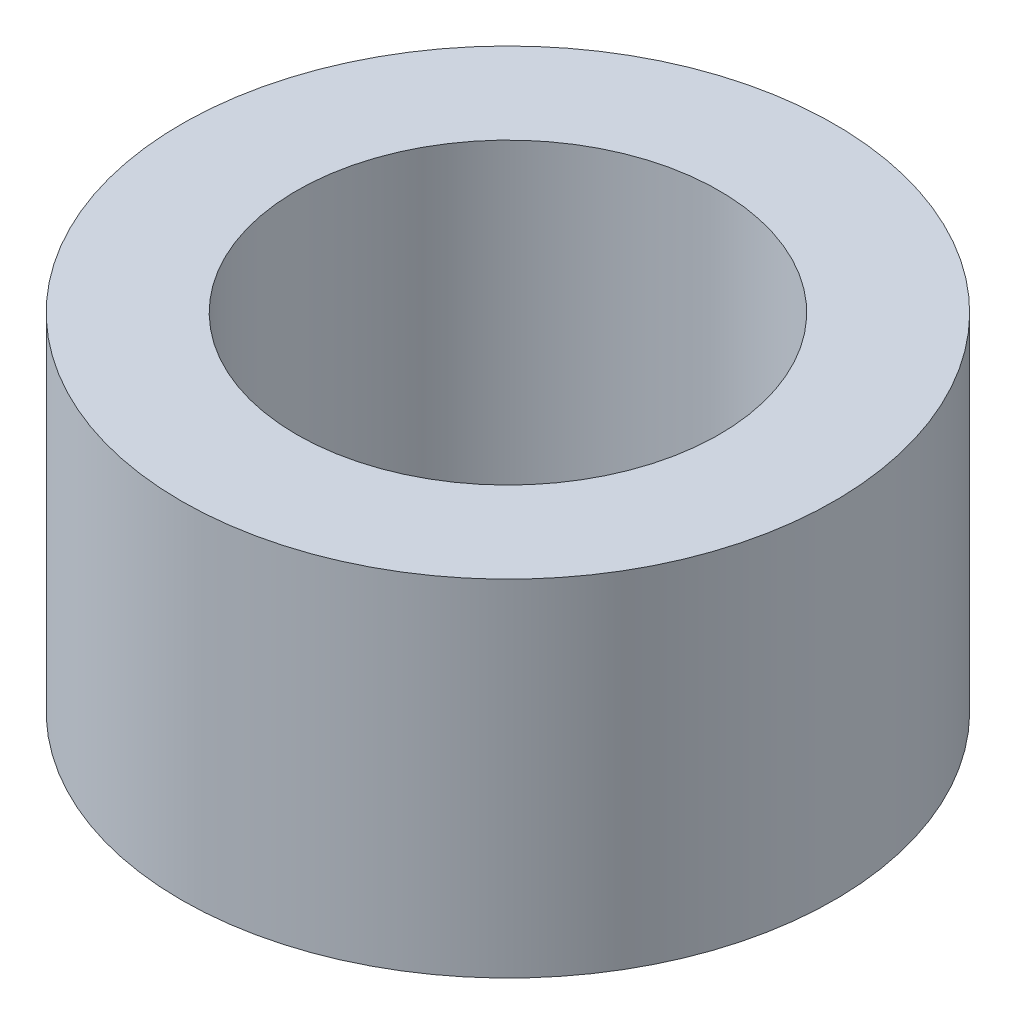
ISO-10303-21;
HEADER;
FILE_DESCRIPTION(('STEP AP214'),'2;1');
FILE_NAME('part.step','',(''),(''),'','','');
FILE_SCHEMA(('AUTOMOTIVE_DESIGN { 1 0 10303 214 1 1 1 1 }'));
ENDSEC;
DATA;
#1=APPLICATION_CONTEXT('core data for automotive mechanical design processes');
#2=APPLICATION_PROTOCOL_DEFINITION('international standard','automotive_design',2000,#1);
#3=PRODUCT_CONTEXT('',#1,'mechanical');
#4=PRODUCT('Part','Part','',(#3));
#5=PRODUCT_RELATED_PRODUCT_CATEGORY('part','',(#4));
#6=PRODUCT_DEFINITION_FORMATION('','',#4);
#7=PRODUCT_DEFINITION_CONTEXT('part definition',#1,'design');
#8=PRODUCT_DEFINITION('design','',#6,#7);
#9=PRODUCT_DEFINITION_SHAPE('','',#8);
#10=(LENGTH_UNIT() NAMED_UNIT(*) SI_UNIT(.MILLI.,.METRE.));
#11=(NAMED_UNIT(*) PLANE_ANGLE_UNIT() SI_UNIT($,.RADIAN.));
#12=(NAMED_UNIT(*) SI_UNIT($,.STERADIAN.) SOLID_ANGLE_UNIT());
#13=UNCERTAINTY_MEASURE_WITH_UNIT(LENGTH_MEASURE(1.E-05),#10,'distance_accuracy_value','');
#14=(GEOMETRIC_REPRESENTATION_CONTEXT(3) GLOBAL_UNCERTAINTY_ASSIGNED_CONTEXT((#13)) GLOBAL_UNIT_ASSIGNED_CONTEXT((#10,
#11,#12)) REPRESENTATION_CONTEXT('',''));
#15=CARTESIAN_POINT('',(0.,0.,0.));
#16=DIRECTION('',(0.,0.,1.));
#17=DIRECTION('',(1.,0.,0.));
#18=AXIS2_PLACEMENT_3D('',#15,#16,#17);
#19=CARTESIAN_POINT('',(0.,15.8699619692714,0.));
#20=DIRECTION('',(0.,-1.,0.));
#21=DIRECTION('',(0.,0.,-1.));
#22=AXIS2_PLACEMENT_3D('',#19,#20,#21);
#23=CYLINDRICAL_SURFACE('',#22,15.);
#24=CARTESIAN_POINT('',(0.,15.8699619692714,0.));
#25=DIRECTION('',(0.,1.,0.));
#26=DIRECTION('',(0.,0.,1.));
#27=AXIS2_PLACEMENT_3D('',#24,#25,#26);
#28=CIRCLE('',#27,15.);
#29=CARTESIAN_POINT('',(0.,15.8699619692714,15.));
#30=VERTEX_POINT('',#29);
#31=EDGE_CURVE('E10',#30,#30,#28,.T.);
#32=ORIENTED_EDGE('',*,*,#31,.F.);
#33=EDGE_LOOP('',(#32));
#34=FACE_BOUND('',#33,.T.);
#35=CARTESIAN_POINT('',(0.,0.,0.));
#36=DIRECTION('',(0.,1.,0.));
#37=DIRECTION('',(0.,0.,1.));
#38=AXIS2_PLACEMENT_3D('',#35,#36,#37);
#39=CIRCLE('',#38,15.);
#40=CARTESIAN_POINT('',(0.,0.,15.));
#41=VERTEX_POINT('',#40);
#42=EDGE_CURVE('E37',#41,#41,#39,.T.);
#43=ORIENTED_EDGE('',*,*,#42,.T.);
#44=EDGE_LOOP('',(#43));
#45=FACE_BOUND('',#44,.T.);
#46=ADVANCED_FACE('F40',(#34,#45),#23,.T.);
#47=CARTESIAN_POINT('',(0.,15.8699619692714,0.));
#48=DIRECTION('',(0.,1.,0.));
#49=DIRECTION('',(0.,0.,1.));
#50=AXIS2_PLACEMENT_3D('',#47,#48,#49);
#51=PLANE('',#50);
#52=CARTESIAN_POINT('',(0.,15.8699619692714,0.));
#53=DIRECTION('',(0.,1.,0.));
#54=DIRECTION('',(0.,0.,1.));
#55=AXIS2_PLACEMENT_3D('',#52,#53,#54);
#56=CIRCLE('',#55,9.70574765657482);
#57=CARTESIAN_POINT('',(0.,15.8699619692714,9.70574765657482));
#58=VERTEX_POINT('',#57);
#59=EDGE_CURVE('E50',#58,#58,#56,.T.);
#60=ORIENTED_EDGE('',*,*,#59,.F.);
#61=EDGE_LOOP('',(#60));
#62=FACE_BOUND('',#61,.T.);
#63=ORIENTED_EDGE('',*,*,#31,.T.);
#64=EDGE_LOOP('',(#63));
#65=FACE_BOUND('',#64,.T.);
#66=ADVANCED_FACE('F59',(#62,#65),#51,.T.);
#67=CARTESIAN_POINT('',(0.,0.,0.));
#68=DIRECTION('',(0.,1.,0.));
#69=DIRECTION('',(0.,0.,1.));
#70=AXIS2_PLACEMENT_3D('',#67,#68,#69);
#71=PLANE('',#70);
#72=CARTESIAN_POINT('',(0.,0.,0.));
#73=DIRECTION('',(0.,1.,0.));
#74=DIRECTION('',(0.,0.,1.));
#75=AXIS2_PLACEMENT_3D('',#72,#73,#74);
#76=CIRCLE('',#75,9.70574765657482);
#77=CARTESIAN_POINT('',(0.,0.,9.70574765657482));
#78=VERTEX_POINT('',#77);
#79=EDGE_CURVE('E47',#78,#78,#76,.T.);
#80=ORIENTED_EDGE('',*,*,#79,.T.);
#81=EDGE_LOOP('',(#80));
#82=FACE_BOUND('',#81,.T.);
#83=ORIENTED_EDGE('',*,*,#42,.F.);
#84=EDGE_LOOP('',(#83));
#85=FACE_BOUND('',#84,.T.);
#86=ADVANCED_FACE('F58',(#82,#85),#71,.F.);
#87=CARTESIAN_POINT('',(0.,15.8699619692714,0.));
#88=DIRECTION('',(0.,-1.,0.));
#89=DIRECTION('',(0.,0.,-1.));
#90=AXIS2_PLACEMENT_3D('',#87,#88,#89);
#91=CYLINDRICAL_SURFACE('',#90,9.70574765657482);
#92=ORIENTED_EDGE('',*,*,#59,.T.);
#93=EDGE_LOOP('',(#92));
#94=FACE_BOUND('',#93,.T.);
#95=ORIENTED_EDGE('',*,*,#79,.F.);
#96=EDGE_LOOP('',(#95));
#97=FACE_BOUND('',#96,.T.);
#98=ADVANCED_FACE('F54',(#94,#97),#91,.F.);
#99=CLOSED_SHELL('',(#46,#66,#86,#98));
#100=MANIFOLD_SOLID_BREP('B2',#99);
#101=ADVANCED_BREP_SHAPE_REPRESENTATION('',(#18,#100),#14);
#102=SHAPE_DEFINITION_REPRESENTATION(#9,#101);
ENDSEC;
END-ISO-10303-21;
